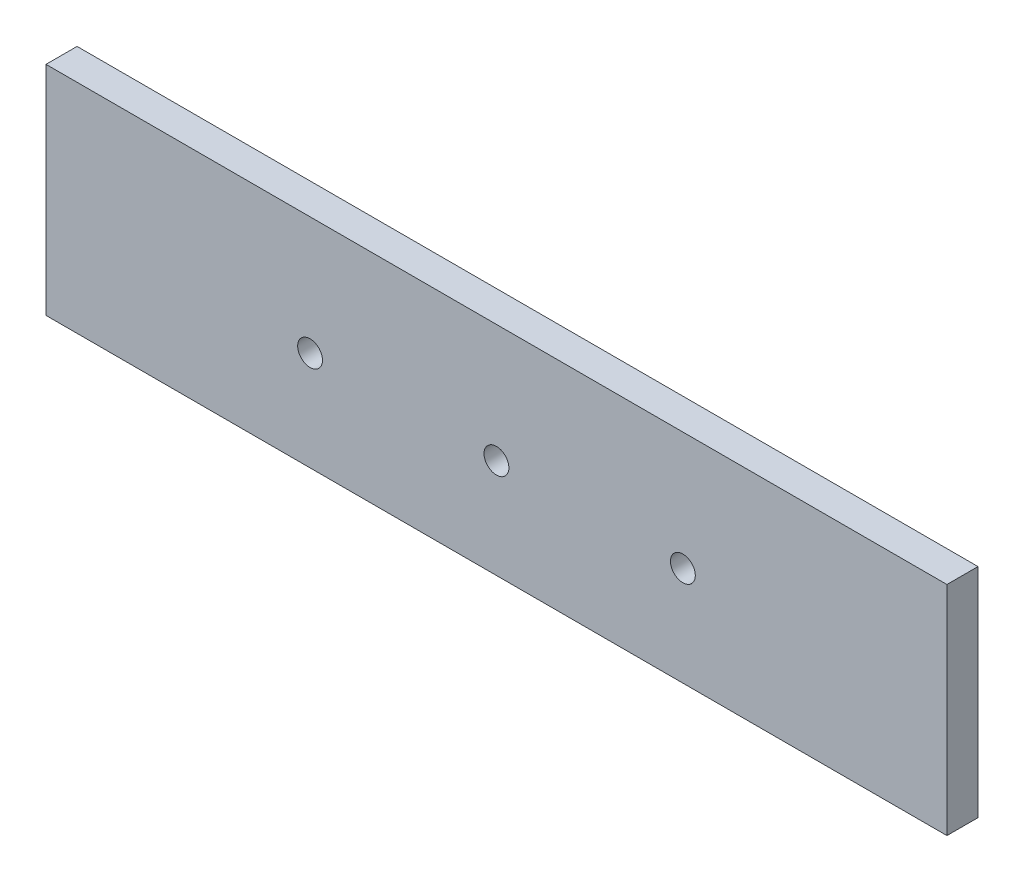
ISO-10303-21;
HEADER;
FILE_DESCRIPTION(('STEP AP214'),'2;1');
FILE_NAME('part.step','',(''),(''),'','','');
FILE_SCHEMA(('AUTOMOTIVE_DESIGN { 1 0 10303 214 1 1 1 1 }'));
ENDSEC;
DATA;
#1=APPLICATION_CONTEXT('core data for automotive mechanical design processes');
#2=APPLICATION_PROTOCOL_DEFINITION('international standard','automotive_design',2000,#1);
#3=PRODUCT_CONTEXT('',#1,'mechanical');
#4=PRODUCT('Part','Part','',(#3));
#5=PRODUCT_RELATED_PRODUCT_CATEGORY('part','',(#4));
#6=PRODUCT_DEFINITION_FORMATION('','',#4);
#7=PRODUCT_DEFINITION_CONTEXT('part definition',#1,'design');
#8=PRODUCT_DEFINITION('design','',#6,#7);
#9=PRODUCT_DEFINITION_SHAPE('','',#8);
#10=(LENGTH_UNIT() NAMED_UNIT(*) SI_UNIT(.MILLI.,.METRE.));
#11=(NAMED_UNIT(*) PLANE_ANGLE_UNIT() SI_UNIT($,.RADIAN.));
#12=(NAMED_UNIT(*) SI_UNIT($,.STERADIAN.) SOLID_ANGLE_UNIT());
#13=UNCERTAINTY_MEASURE_WITH_UNIT(LENGTH_MEASURE(1.E-05),#10,'distance_accuracy_value','');
#14=(GEOMETRIC_REPRESENTATION_CONTEXT(3) GLOBAL_UNCERTAINTY_ASSIGNED_CONTEXT((#13)) GLOBAL_UNIT_ASSIGNED_CONTEXT((#10,
#11,#12)) REPRESENTATION_CONTEXT('',''));
#15=CARTESIAN_POINT('',(0.,0.,0.));
#16=DIRECTION('',(0.,0.,1.));
#17=DIRECTION('',(1.,0.,0.));
#18=AXIS2_PLACEMENT_3D('',#15,#16,#17);
#19=CARTESIAN_POINT('',(-92.075,-22.225,6.35));
#20=DIRECTION('',(1.,0.,0.));
#21=DIRECTION('',(0.,0.,-1.));
#22=AXIS2_PLACEMENT_3D('',#19,#20,#21);
#23=PLANE('',#22);
#24=DIRECTION('',(0.,-1.,0.));
#25=VECTOR('',#24,1.);
#26=CARTESIAN_POINT('',(-92.075,-22.225,0.));
#27=LINE('',#26,#25);
#28=CARTESIAN_POINT('',(-92.075,22.225,0.));
#29=VERTEX_POINT('',#28);
#30=CARTESIAN_POINT('',(-92.075,-22.225,0.));
#31=VERTEX_POINT('',#30);
#32=EDGE_CURVE('E98',#29,#31,#27,.T.);
#33=ORIENTED_EDGE('',*,*,#32,.T.);
#34=DIRECTION('',(0.,0.,-1.));
#35=VECTOR('',#34,1.);
#36=CARTESIAN_POINT('',(-92.075,-22.225,6.35));
#37=LINE('',#36,#35);
#38=CARTESIAN_POINT('',(-92.075,-22.225,6.35));
#39=VERTEX_POINT('',#38);
#40=EDGE_CURVE('E11',#39,#31,#37,.T.);
#41=ORIENTED_EDGE('',*,*,#40,.F.);
#42=DIRECTION('',(0.,-1.,0.));
#43=VECTOR('',#42,1.);
#44=CARTESIAN_POINT('',(-92.075,-22.225,6.35));
#45=LINE('',#44,#43);
#46=CARTESIAN_POINT('',(-92.075,22.225,6.35));
#47=VERTEX_POINT('',#46);
#48=EDGE_CURVE('E86',#47,#39,#45,.T.);
#49=ORIENTED_EDGE('',*,*,#48,.F.);
#50=DIRECTION('',(0.,0.,-1.));
#51=VECTOR('',#50,1.);
#52=CARTESIAN_POINT('',(-92.075,22.225,6.35));
#53=LINE('',#52,#51);
#54=EDGE_CURVE('E94',#47,#29,#53,.T.);
#55=ORIENTED_EDGE('',*,*,#54,.T.);
#56=EDGE_LOOP('',(#33,#41,#49,#55));
#57=FACE_BOUND('',#56,.T.);
#58=ADVANCED_FACE('F35',(#57),#23,.F.);
#59=CARTESIAN_POINT('',(92.075,-22.225,6.35));
#60=DIRECTION('',(0.,1.,0.));
#61=DIRECTION('',(-1.,0.,0.));
#62=AXIS2_PLACEMENT_3D('',#59,#60,#61);
#63=PLANE('',#62);
#64=DIRECTION('',(1.,0.,0.));
#65=VECTOR('',#64,1.);
#66=CARTESIAN_POINT('',(92.075,-22.225,0.));
#67=LINE('',#66,#65);
#68=CARTESIAN_POINT('',(92.075,-22.225,0.));
#69=VERTEX_POINT('',#68);
#70=EDGE_CURVE('E90',#31,#69,#67,.T.);
#71=ORIENTED_EDGE('',*,*,#70,.T.);
#72=DIRECTION('',(0.,0.,-1.));
#73=VECTOR('',#72,1.);
#74=CARTESIAN_POINT('',(92.075,-22.225,6.35));
#75=LINE('',#74,#73);
#76=CARTESIAN_POINT('',(92.075,-22.225,6.35));
#77=VERTEX_POINT('',#76);
#78=EDGE_CURVE('E43',#77,#69,#75,.T.);
#79=ORIENTED_EDGE('',*,*,#78,.F.);
#80=DIRECTION('',(1.,0.,0.));
#81=VECTOR('',#80,1.);
#82=CARTESIAN_POINT('',(92.075,-22.225,6.35));
#83=LINE('',#82,#81);
#84=EDGE_CURVE('E81',#39,#77,#83,.T.);
#85=ORIENTED_EDGE('',*,*,#84,.F.);
#86=ORIENTED_EDGE('',*,*,#40,.T.);
#87=EDGE_LOOP('',(#71,#79,#85,#86));
#88=FACE_BOUND('',#87,.T.);
#89=ADVANCED_FACE('F89',(#88),#63,.F.);
#90=CARTESIAN_POINT('',(92.075,-22.225,6.35));
#91=DIRECTION('',(-1.,0.,0.));
#92=DIRECTION('',(0.,0.,1.));
#93=AXIS2_PLACEMENT_3D('',#90,#91,#92);
#94=PLANE('',#93);
#95=DIRECTION('',(0.,1.,0.));
#96=VECTOR('',#95,1.);
#97=CARTESIAN_POINT('',(92.075,-22.225,0.));
#98=LINE('',#97,#96);
#99=CARTESIAN_POINT('',(92.075,22.225,0.));
#100=VERTEX_POINT('',#99);
#101=EDGE_CURVE('E68',#69,#100,#98,.T.);
#102=ORIENTED_EDGE('',*,*,#101,.T.);
#103=DIRECTION('',(0.,0.,-1.));
#104=VECTOR('',#103,1.);
#105=CARTESIAN_POINT('',(92.075,22.225,6.35));
#106=LINE('',#105,#104);
#107=CARTESIAN_POINT('',(92.075,22.225,6.35));
#108=VERTEX_POINT('',#107);
#109=EDGE_CURVE('E91',#108,#100,#106,.T.);
#110=ORIENTED_EDGE('',*,*,#109,.F.);
#111=DIRECTION('',(0.,1.,0.));
#112=VECTOR('',#111,1.);
#113=CARTESIAN_POINT('',(92.075,-22.225,6.35));
#114=LINE('',#113,#112);
#115=EDGE_CURVE('E84',#77,#108,#114,.T.);
#116=ORIENTED_EDGE('',*,*,#115,.F.);
#117=ORIENTED_EDGE('',*,*,#78,.T.);
#118=EDGE_LOOP('',(#102,#110,#116,#117));
#119=FACE_BOUND('',#118,.T.);
#120=ADVANCED_FACE('F92',(#119),#94,.F.);
#121=CARTESIAN_POINT('',(92.075,22.225,6.35));
#122=DIRECTION('',(0.,-1.,0.));
#123=DIRECTION('',(1.,0.,0.));
#124=AXIS2_PLACEMENT_3D('',#121,#122,#123);
#125=PLANE('',#124);
#126=DIRECTION('',(-1.,0.,0.));
#127=VECTOR('',#126,1.);
#128=CARTESIAN_POINT('',(92.075,22.225,0.));
#129=LINE('',#128,#127);
#130=EDGE_CURVE('E74',#100,#29,#129,.T.);
#131=ORIENTED_EDGE('',*,*,#130,.T.);
#132=ORIENTED_EDGE('',*,*,#54,.F.);
#133=DIRECTION('',(-1.,0.,0.));
#134=VECTOR('',#133,1.);
#135=CARTESIAN_POINT('',(92.075,22.225,6.35));
#136=LINE('',#135,#134);
#137=EDGE_CURVE('E51',#108,#47,#136,.T.);
#138=ORIENTED_EDGE('',*,*,#137,.F.);
#139=ORIENTED_EDGE('',*,*,#109,.T.);
#140=EDGE_LOOP('',(#131,#132,#138,#139));
#141=FACE_BOUND('',#140,.T.);
#142=ADVANCED_FACE('F106',(#141),#125,.F.);
#143=CARTESIAN_POINT('',(0.,0.,6.35));
#144=DIRECTION('',(0.,0.,1.));
#145=DIRECTION('',(1.,0.,0.));
#146=AXIS2_PLACEMENT_3D('',#143,#144,#145);
#147=PLANE('',#146);
#148=CARTESIAN_POINT('',(-38.1,-1.90500000000001,6.35));
#149=DIRECTION('',(0.,0.,1.));
#150=DIRECTION('',(1.,0.,0.));
#151=AXIS2_PLACEMENT_3D('',#148,#149,#150);
#152=CIRCLE('',#151,2.54);
#153=CARTESIAN_POINT('',(-35.56,-1.90500000000001,6.35));
#154=VERTEX_POINT('',#153);
#155=EDGE_CURVE('E124',#154,#154,#152,.T.);
#156=ORIENTED_EDGE('',*,*,#155,.F.);
#157=EDGE_LOOP('',(#156));
#158=FACE_BOUND('',#157,.T.);
#159=CARTESIAN_POINT('',(0.,-1.90500000000002,6.35));
#160=DIRECTION('',(0.,0.,1.));
#161=DIRECTION('',(1.,0.,0.));
#162=AXIS2_PLACEMENT_3D('',#159,#160,#161);
#163=CIRCLE('',#162,2.54);
#164=CARTESIAN_POINT('',(2.54000000000002,-1.90500000000002,6.35));
#165=VERTEX_POINT('',#164);
#166=EDGE_CURVE('E121',#165,#165,#163,.T.);
#167=ORIENTED_EDGE('',*,*,#166,.F.);
#168=EDGE_LOOP('',(#167));
#169=FACE_BOUND('',#168,.T.);
#170=CARTESIAN_POINT('',(38.1,-1.90500000000002,6.35));
#171=DIRECTION('',(0.,0.,1.));
#172=DIRECTION('',(1.,0.,0.));
#173=AXIS2_PLACEMENT_3D('',#170,#171,#172);
#174=CIRCLE('',#173,2.54);
#175=CARTESIAN_POINT('',(40.64,-1.90500000000002,6.35));
#176=VERTEX_POINT('',#175);
#177=EDGE_CURVE('E115',#176,#176,#174,.T.);
#178=ORIENTED_EDGE('',*,*,#177,.F.);
#179=EDGE_LOOP('',(#178));
#180=FACE_BOUND('',#179,.T.);
#181=ORIENTED_EDGE('',*,*,#48,.T.);
#182=ORIENTED_EDGE('',*,*,#84,.T.);
#183=ORIENTED_EDGE('',*,*,#115,.T.);
#184=ORIENTED_EDGE('',*,*,#137,.T.);
#185=EDGE_LOOP('',(#181,#182,#183,#184));
#186=FACE_BOUND('',#185,.T.);
#187=ADVANCED_FACE('F82',(#158,#169,#180,#186),#147,.T.);
#188=CARTESIAN_POINT('',(0.,0.,0.));
#189=DIRECTION('',(0.,0.,1.));
#190=DIRECTION('',(1.,0.,0.));
#191=AXIS2_PLACEMENT_3D('',#188,#189,#190);
#192=PLANE('',#191);
#193=CARTESIAN_POINT('',(-38.1,-1.90500000000001,0.));
#194=DIRECTION('',(0.,0.,1.));
#195=DIRECTION('',(1.,0.,0.));
#196=AXIS2_PLACEMENT_3D('',#193,#194,#195);
#197=CIRCLE('',#196,2.54);
#198=CARTESIAN_POINT('',(-35.56,-1.90500000000001,0.));
#199=VERTEX_POINT('',#198);
#200=EDGE_CURVE('E101',#199,#199,#197,.T.);
#201=ORIENTED_EDGE('',*,*,#200,.T.);
#202=EDGE_LOOP('',(#201));
#203=FACE_BOUND('',#202,.T.);
#204=CARTESIAN_POINT('',(0.,-1.90500000000002,0.));
#205=DIRECTION('',(0.,0.,1.));
#206=DIRECTION('',(1.,0.,0.));
#207=AXIS2_PLACEMENT_3D('',#204,#205,#206);
#208=CIRCLE('',#207,2.54);
#209=CARTESIAN_POINT('',(2.54000000000002,-1.90500000000002,0.));
#210=VERTEX_POINT('',#209);
#211=EDGE_CURVE('E118',#210,#210,#208,.T.);
#212=ORIENTED_EDGE('',*,*,#211,.T.);
#213=EDGE_LOOP('',(#212));
#214=FACE_BOUND('',#213,.T.);
#215=CARTESIAN_POINT('',(38.1,-1.90500000000002,0.));
#216=DIRECTION('',(0.,0.,1.));
#217=DIRECTION('',(1.,0.,0.));
#218=AXIS2_PLACEMENT_3D('',#215,#216,#217);
#219=CIRCLE('',#218,2.54);
#220=CARTESIAN_POINT('',(40.64,-1.90500000000002,0.));
#221=VERTEX_POINT('',#220);
#222=EDGE_CURVE('E112',#221,#221,#219,.T.);
#223=ORIENTED_EDGE('',*,*,#222,.T.);
#224=EDGE_LOOP('',(#223));
#225=FACE_BOUND('',#224,.T.);
#226=ORIENTED_EDGE('',*,*,#32,.F.);
#227=ORIENTED_EDGE('',*,*,#130,.F.);
#228=ORIENTED_EDGE('',*,*,#101,.F.);
#229=ORIENTED_EDGE('',*,*,#70,.F.);
#230=EDGE_LOOP('',(#226,#227,#228,#229));
#231=FACE_BOUND('',#230,.T.);
#232=ADVANCED_FACE('F109',(#203,#214,#225,#231),#192,.F.);
#233=CARTESIAN_POINT('',(38.1,-1.90500000000002,0.));
#234=DIRECTION('',(0.,0.,1.));
#235=DIRECTION('',(1.,0.,0.));
#236=AXIS2_PLACEMENT_3D('',#233,#234,#235);
#237=CYLINDRICAL_SURFACE('',#236,2.54);
#238=ORIENTED_EDGE('',*,*,#222,.F.);
#239=EDGE_LOOP('',(#238));
#240=FACE_BOUND('',#239,.T.);
#241=ORIENTED_EDGE('',*,*,#177,.T.);
#242=EDGE_LOOP('',(#241));
#243=FACE_BOUND('',#242,.T.);
#244=ADVANCED_FACE('F146',(#240,#243),#237,.F.);
#245=CARTESIAN_POINT('',(0.,-1.90500000000002,0.));
#246=DIRECTION('',(0.,0.,1.));
#247=DIRECTION('',(1.,0.,0.));
#248=AXIS2_PLACEMENT_3D('',#245,#246,#247);
#249=CYLINDRICAL_SURFACE('',#248,2.54);
#250=ORIENTED_EDGE('',*,*,#211,.F.);
#251=EDGE_LOOP('',(#250));
#252=FACE_BOUND('',#251,.T.);
#253=ORIENTED_EDGE('',*,*,#166,.T.);
#254=EDGE_LOOP('',(#253));
#255=FACE_BOUND('',#254,.T.);
#256=ADVANCED_FACE('F135',(#252,#255),#249,.F.);
#257=CARTESIAN_POINT('',(-38.1,-1.90500000000001,0.));
#258=DIRECTION('',(0.,0.,1.));
#259=DIRECTION('',(1.,0.,0.));
#260=AXIS2_PLACEMENT_3D('',#257,#258,#259);
#261=CYLINDRICAL_SURFACE('',#260,2.54);
#262=ORIENTED_EDGE('',*,*,#200,.F.);
#263=EDGE_LOOP('',(#262));
#264=FACE_BOUND('',#263,.T.);
#265=ORIENTED_EDGE('',*,*,#155,.T.);
#266=EDGE_LOOP('',(#265));
#267=FACE_BOUND('',#266,.T.);
#268=ADVANCED_FACE('F132',(#264,#267),#261,.F.);
#269=CLOSED_SHELL('',(#58,#89,#120,#142,#187,#232,#244,#256,#268));
#270=MANIFOLD_SOLID_BREP('B2',#269);
#271=ADVANCED_BREP_SHAPE_REPRESENTATION('',(#18,#270),#14);
#272=SHAPE_DEFINITION_REPRESENTATION(#9,#271);
ENDSEC;
END-ISO-10303-21;
